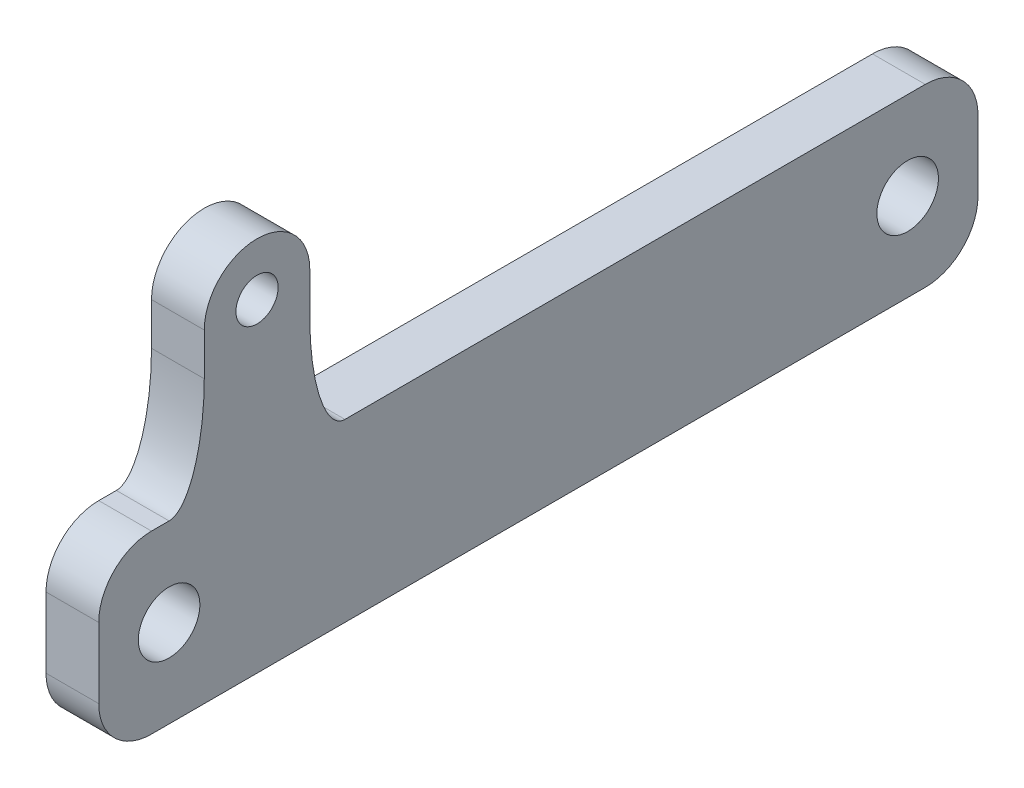
ISO-10303-21;
HEADER;
FILE_DESCRIPTION(('STEP AP214'),'2;1');
FILE_NAME('part.step','',(''),(''),'','','');
FILE_SCHEMA(('AUTOMOTIVE_DESIGN { 1 0 10303 214 1 1 1 1 }'));
ENDSEC;
DATA;
#1=APPLICATION_CONTEXT('core data for automotive mechanical design processes');
#2=APPLICATION_PROTOCOL_DEFINITION('international standard','automotive_design',2000,#1);
#3=PRODUCT_CONTEXT('',#1,'mechanical');
#4=PRODUCT('Part','Part','',(#3));
#5=PRODUCT_RELATED_PRODUCT_CATEGORY('part','',(#4));
#6=PRODUCT_DEFINITION_FORMATION('','',#4);
#7=PRODUCT_DEFINITION_CONTEXT('part definition',#1,'design');
#8=PRODUCT_DEFINITION('design','',#6,#7);
#9=PRODUCT_DEFINITION_SHAPE('','',#8);
#10=(LENGTH_UNIT() NAMED_UNIT(*) SI_UNIT(.MILLI.,.METRE.));
#11=(NAMED_UNIT(*) PLANE_ANGLE_UNIT() SI_UNIT($,.RADIAN.));
#12=(NAMED_UNIT(*) SI_UNIT($,.STERADIAN.) SOLID_ANGLE_UNIT());
#13=UNCERTAINTY_MEASURE_WITH_UNIT(LENGTH_MEASURE(1.E-05),#10,'distance_accuracy_value','');
#14=(GEOMETRIC_REPRESENTATION_CONTEXT(3) GLOBAL_UNCERTAINTY_ASSIGNED_CONTEXT((#13)) GLOBAL_UNIT_ASSIGNED_CONTEXT((#10,
#11,#12)) REPRESENTATION_CONTEXT('',''));
#15=CARTESIAN_POINT('',(0.,0.,0.));
#16=DIRECTION('',(0.,0.,1.));
#17=DIRECTION('',(1.,0.,0.));
#18=AXIS2_PLACEMENT_3D('',#15,#16,#17);
#19=CARTESIAN_POINT('',(-61.0000000000002,-7.50000000000045,105.000000000001));
#20=DIRECTION('',(0.,-0.999999999999999,0.));
#21=DIRECTION('',(1.,0.,0.));
#22=AXIS2_PLACEMENT_3D('',#19,#20,#21);
#23=PLANE('',#22);
#24=DIRECTION('',(0.,0.,-0.999999999999999));
#25=VECTOR('',#24,1.);
#26=CARTESIAN_POINT('',(-46.0000000000003,-7.50000000000145,105.000000000001));
#27=LINE('',#26,#25);
#28=CARTESIAN_POINT('',(-45.9999999999998,-7.50000000000162,34.9999999999997));
#29=VERTEX_POINT('',#28);
#30=CARTESIAN_POINT('',(-46.0000000000003,-7.50000000000092,-129.999999999997));
#31=VERTEX_POINT('',#30);
#32=EDGE_CURVE('E194',#29,#31,#27,.T.);
#33=ORIENTED_EDGE('',*,*,#32,.T.);
#34=DIRECTION('',(-1.,0.,0.));
#35=VECTOR('',#34,1.);
#36=CARTESIAN_POINT('',(-61.0000000000002,-7.50000000000114,-129.999999999998));
#37=LINE('',#36,#35);
#38=CARTESIAN_POINT('',(-61.0000000000002,-7.50000000000114,-129.999999999998));
#39=VERTEX_POINT('',#38);
#40=EDGE_CURVE('E312',#31,#39,#37,.T.);
#41=ORIENTED_EDGE('',*,*,#40,.T.);
#42=DIRECTION('',(0.,0.,-0.999999999999999));
#43=VECTOR('',#42,1.);
#44=CARTESIAN_POINT('',(-61.0000000000002,-7.50000000000045,105.000000000001));
#45=LINE('',#44,#43);
#46=CARTESIAN_POINT('',(-60.9999999999997,-7.50000000000128,35.0000000000001));
#47=VERTEX_POINT('',#46);
#48=EDGE_CURVE('E375',#47,#39,#45,.T.);
#49=ORIENTED_EDGE('',*,*,#48,.F.);
#50=CARTESIAN_POINT('',(-45.2499999999998,-7.50000000000162,34.9999999999997));
#51=CARTESIAN_POINT('',(-50.7499999999996,-7.50000000000148,34.9999999999998));
#52=CARTESIAN_POINT('',(-56.2499999999997,-7.50000000000142,35.0000000000001));
#53=CARTESIAN_POINT('',(-61.7499999999997,-7.50000000000151,35.0000000000004));
#54=(BOUNDED_CURVE() B_SPLINE_CURVE(3,(#50,#51,#52,#53),.UNSPECIFIED.,.F.,
.F.) B_SPLINE_CURVE_WITH_KNOTS((4,4),(0.0636627316607518,0.0801627316607518),
.UNSPECIFIED.) CURVE() GEOMETRIC_REPRESENTATION_ITEM() RATIONAL_B_SPLINE_CURVE((1.,1.,1.,1.)) REPRESENTATION_ITEM(''));
#55=EDGE_CURVE('E314',#47,#29,#54,.F.);
#56=ORIENTED_EDGE('',*,*,#55,.T.);
#57=EDGE_LOOP('',(#33,#41,#49,#56));
#58=FACE_BOUND('',#57,.T.);
#59=ADVANCED_FACE('F42',(#58),#23,.F.);
#60=CARTESIAN_POINT('',(-60.9999999999984,-7.50000000000128,90.0000000000003));
#61=VERTEX_POINT('',#60);
#62=CARTESIAN_POINT('',(-60.9999999999987,-7.50000000000053,84.9999999999997));
#63=VERTEX_POINT('',#62);
#64=EDGE_CURVE('E372',#61,#63,#45,.T.);
#65=ORIENTED_EDGE('',*,*,#64,.F.);
#66=DIRECTION('',(-1.,0.,0.));
#67=VECTOR('',#66,1.);
#68=CARTESIAN_POINT('',(-60.9999999999984,-7.50000000000128,90.0000000000003));
#69=LINE('',#68,#67);
#70=CARTESIAN_POINT('',(-45.9999999999982,-7.5000000000004,90.0000000000029));
#71=VERTEX_POINT('',#70);
#72=EDGE_CURVE('E12',#61,#71,#69,.F.);
#73=ORIENTED_EDGE('',*,*,#72,.T.);
#74=CARTESIAN_POINT('',(-45.9999999999988,-7.50000000000067,85.0000000000024));
#75=VERTEX_POINT('',#74);
#76=EDGE_CURVE('E317',#71,#75,#27,.T.);
#77=ORIENTED_EDGE('',*,*,#76,.T.);
#78=CARTESIAN_POINT('',(-61.7499999999987,-7.5000000000012,85.000000000002));
#79=CARTESIAN_POINT('',(-56.2499999999989,-7.50000000000056,85.));
#80=CARTESIAN_POINT('',(-50.7499999999988,-7.49999999999937,85.0000000000029));
#81=CARTESIAN_POINT('',(-45.2499999999988,-7.50000000000114,85.000000000002));
#82=(BOUNDED_CURVE() B_SPLINE_CURVE(3,(#78,#79,#80,#81),.UNSPECIFIED.,.F.,
.F.) B_SPLINE_CURVE_WITH_KNOTS((4,4),(-0.01575,0.000750000000000001),
.UNSPECIFIED.) CURVE() GEOMETRIC_REPRESENTATION_ITEM() RATIONAL_B_SPLINE_CURVE((1.,1.,1.,1.)) REPRESENTATION_ITEM(''));
#83=EDGE_CURVE('E393',#75,#63,#82,.F.);
#84=ORIENTED_EDGE('',*,*,#83,.T.);
#85=EDGE_LOOP('',(#65,#73,#77,#84));
#86=FACE_BOUND('',#85,.T.);
#87=ADVANCED_FACE('F244',(#86),#23,.F.);
#88=CARTESIAN_POINT('',(-61.0000000000002,-7.50000000000045,105.000000000001));
#89=DIRECTION('',(1.,0.,0.));
#90=DIRECTION('',(0.,0.999999999999999,0.));
#91=AXIS2_PLACEMENT_3D('',#88,#89,#90);
#92=PLANE('',#91);
#93=CARTESIAN_POINT('',(-60.9999999999993,-32.5000000000014,-124.999999999998));
#94=DIRECTION('',(-1.,0.,0.));
#95=DIRECTION('',(0.,-0.999999999999999,0.));
#96=AXIS2_PLACEMENT_3D('',#93,#94,#95);
#97=CIRCLE('',#96,8.75000000000001);
#98=CARTESIAN_POINT('',(-60.9999999999992,-41.2500000000014,-124.999999999998));
#99=VERTEX_POINT('',#98);
#100=EDGE_CURVE('E423',#99,#99,#97,.T.);
#101=ORIENTED_EDGE('',*,*,#100,.F.);
#102=EDGE_LOOP('',(#101));
#103=FACE_BOUND('',#102,.T.);
#104=CARTESIAN_POINT('',(-60.9999999999986,-32.5000000000007,85.0000000000002));
#105=DIRECTION('',(-1.,0.,0.));
#106=DIRECTION('',(0.,0.999999999999999,0.));
#107=AXIS2_PLACEMENT_3D('',#104,#105,#106);
#108=CIRCLE('',#107,8.75000000000001);
#109=CARTESIAN_POINT('',(-60.9999999999986,-23.7500000000007,85.0000000000002));
#110=VERTEX_POINT('',#109);
#111=EDGE_CURVE('E421',#110,#110,#108,.T.);
#112=ORIENTED_EDGE('',*,*,#111,.F.);
#113=EDGE_LOOP('',(#112));
#114=FACE_BOUND('',#113,.T.);
#115=DIRECTION('',(0.,-0.999999999999999,0.));
#116=VECTOR('',#115,1.);
#117=CARTESIAN_POINT('',(-61.0000000000007,-7.50000000000112,-145.));
#118=LINE('',#117,#116);
#119=CARTESIAN_POINT('',(-60.999999999999,-22.5000000000011,-144.999999999998));
#120=VERTEX_POINT('',#119);
#121=CARTESIAN_POINT('',(-60.9999999999988,-42.5000000000007,-144.999999999999));
#122=VERTEX_POINT('',#121);
#123=EDGE_CURVE('E349',#120,#122,#118,.T.);
#124=ORIENTED_EDGE('',*,*,#123,.T.);
#125=CARTESIAN_POINT('',(-60.9999999999993,-42.499999999999,-129.999999999997));
#126=DIRECTION('',(1.,0.,0.));
#127=DIRECTION('',(0.,0.999999999999999,0.));
#128=AXIS2_PLACEMENT_3D('',#125,#126,#127);
#129=CIRCLE('',#128,15.);
#130=CARTESIAN_POINT('',(-60.9999999999989,-57.5000000000009,-129.999999999998));
#131=VERTEX_POINT('',#130);
#132=EDGE_CURVE('E323',#122,#131,#129,.F.);
#133=ORIENTED_EDGE('',*,*,#132,.T.);
#134=DIRECTION('',(0.,0.,-0.999999999999999));
#135=VECTOR('',#134,1.);
#136=CARTESIAN_POINT('',(-60.9999999999976,-57.5000000000002,105.000000000001));
#137=LINE('',#136,#135);
#138=CARTESIAN_POINT('',(-60.9999999999987,-57.5,90.0000000000019));
#139=VERTEX_POINT('',#138);
#140=EDGE_CURVE('E379',#139,#131,#137,.T.);
#141=ORIENTED_EDGE('',*,*,#140,.F.);
#142=CARTESIAN_POINT('',(-60.9999999999989,-42.5000000000005,90.0000000000019));
#143=DIRECTION('',(1.,0.,0.));
#144=DIRECTION('',(0.,0.999999999999999,0.));
#145=AXIS2_PLACEMENT_3D('',#142,#143,#144);
#146=CIRCLE('',#145,15.);
#147=CARTESIAN_POINT('',(-60.9999999999994,-42.5000000000007,105.000000000002));
#148=VERTEX_POINT('',#147);
#149=EDGE_CURVE('E533',#139,#148,#146,.F.);
#150=ORIENTED_EDGE('',*,*,#149,.T.);
#151=DIRECTION('',(0.,-0.999999999999999,0.));
#152=VECTOR('',#151,1.);
#153=CARTESIAN_POINT('',(-61.0000000000002,-7.50000000000045,105.000000000001));
#154=LINE('',#153,#152);
#155=CARTESIAN_POINT('',(-60.9999999999987,-22.5000000000005,105.000000000002));
#156=VERTEX_POINT('',#155);
#157=EDGE_CURVE('E335',#156,#148,#154,.T.);
#158=ORIENTED_EDGE('',*,*,#157,.F.);
#159=CARTESIAN_POINT('',(-60.9999999999986,-22.5000000000011,90.0000000000022));
#160=DIRECTION('',(1.,0.,0.));
#161=DIRECTION('',(0.,0.999999999999999,0.));
#162=AXIS2_PLACEMENT_3D('',#159,#160,#161);
#163=CIRCLE('',#162,15.);
#164=EDGE_CURVE('E65',#156,#61,#163,.F.);
#165=ORIENTED_EDGE('',*,*,#164,.T.);
#166=ORIENTED_EDGE('',*,*,#64,.T.);
#167=CARTESIAN_POINT('',(-60.999999999999,22.4999999999982,74.999999999999));
#168=CARTESIAN_POINT('',(-61.0000000000007,-7.49999999999692,74.9999999999995));
#169=CARTESIAN_POINT('',(-60.9999999999988,-7.50000000000111,85.0000000000017));
#170=(BOUNDED_CURVE() B_SPLINE_CURVE(2,(#167,#168,#169),.UNSPECIFIED.,.F.,
.F.) B_SPLINE_CURVE_WITH_KNOTS((3,3),(0.,1.),
.UNSPECIFIED.) CURVE() GEOMETRIC_REPRESENTATION_ITEM() RATIONAL_B_SPLINE_CURVE((1.,
0.707106781186547,1.)) REPRESENTATION_ITEM(''));
#171=CARTESIAN_POINT('',(-60.9999999999989,22.4999999999983,74.9999999999986));
#172=VERTEX_POINT('',#171);
#173=EDGE_CURVE('E152',#63,#172,#170,.F.);
#174=ORIENTED_EDGE('',*,*,#173,.T.);
#175=DIRECTION('',(0.,0.999999999999999,0.));
#176=VECTOR('',#175,1.);
#177=CARTESIAN_POINT('',(-60.9999999999981,-7.50000000000159,74.9999999999991));
#178=LINE('',#177,#176);
#179=CARTESIAN_POINT('',(-60.9999999999988,34.4999999999986,75.0000000000028));
#180=VERTEX_POINT('',#179);
#181=EDGE_CURVE('E142',#172,#180,#178,.T.);
#182=ORIENTED_EDGE('',*,*,#181,.T.);
#183=CARTESIAN_POINT('',(-60.9999999999993,34.4999999999987,59.9999999999997));
#184=DIRECTION('',(-1.,0.,0.));
#185=DIRECTION('',(0.,0.999999999999999,0.));
#186=AXIS2_PLACEMENT_3D('',#183,#184,#185);
#187=CIRCLE('',#186,15.);
#188=CARTESIAN_POINT('',(-60.9999999999989,34.4999999999997,45.0000000000019));
#189=VERTEX_POINT('',#188);
#190=EDGE_CURVE('E149',#180,#189,#187,.T.);
#191=ORIENTED_EDGE('',*,*,#190,.T.);
#192=DIRECTION('',(0.,-0.999999999999999,0.));
#193=VECTOR('',#192,1.);
#194=CARTESIAN_POINT('',(-60.9999999999988,-7.50000000000109,45.000000000001));
#195=LINE('',#194,#193);
#196=CARTESIAN_POINT('',(-60.9999999999991,22.4999999999986,45.0000000000027));
#197=VERTEX_POINT('',#196);
#198=EDGE_CURVE('E167',#189,#197,#195,.T.);
#199=ORIENTED_EDGE('',*,*,#198,.T.);
#200=CARTESIAN_POINT('',(-60.9999999999998,-7.50000000000149,35.0000000000003));
#201=CARTESIAN_POINT('',(-60.9999999999998,-7.49999999999991,45.0000000000014));
#202=CARTESIAN_POINT('',(-60.9999999999989,22.4999999999985,45.0000000000015));
#203=(BOUNDED_CURVE() B_SPLINE_CURVE(2,(#200,#201,#202),.UNSPECIFIED.,.F.,
.F.) B_SPLINE_CURVE_WITH_KNOTS((3,3),(0.,1.),
.UNSPECIFIED.) CURVE() GEOMETRIC_REPRESENTATION_ITEM() RATIONAL_B_SPLINE_CURVE((1.,
0.707106781186548,1.)) REPRESENTATION_ITEM(''));
#204=EDGE_CURVE('E227',#197,#47,#203,.F.);
#205=ORIENTED_EDGE('',*,*,#204,.T.);
#206=ORIENTED_EDGE('',*,*,#48,.T.);
#207=CARTESIAN_POINT('',(-60.9999999999987,-22.500000000001,-129.999999999999));
#208=DIRECTION('',(1.,0.,0.));
#209=DIRECTION('',(0.,0.999999999999999,0.));
#210=AXIS2_PLACEMENT_3D('',#207,#208,#209);
#211=CIRCLE('',#210,15.);
#212=EDGE_CURVE('E57',#39,#120,#211,.F.);
#213=ORIENTED_EDGE('',*,*,#212,.T.);
#214=EDGE_LOOP('',(#124,#133,#141,#150,#158,#165,#166,#174,#182,#191,#199,#205,#206,#213));
#215=FACE_BOUND('',#214,.T.);
#216=CARTESIAN_POINT('',(-60.9999999999993,34.4999999999987,59.9999999999997));
#217=DIRECTION('',(-1.,0.,0.));
#218=DIRECTION('',(0.,-0.999999999999999,0.));
#219=AXIS2_PLACEMENT_3D('',#216,#217,#218);
#220=CIRCLE('',#219,5.99999999999999);
#221=CARTESIAN_POINT('',(-60.9999999999992,28.4999999999987,59.9999999999997));
#222=VERTEX_POINT('',#221);
#223=EDGE_CURVE('E156',#222,#222,#220,.T.);
#224=ORIENTED_EDGE('',*,*,#223,.F.);
#225=EDGE_LOOP('',(#224));
#226=FACE_BOUND('',#225,.T.);
#227=ADVANCED_FACE('F145',(#103,#114,#215,#226),#92,.F.);
#228=CARTESIAN_POINT('',(-45.9999999999975,-57.5000000000008,105.000000000001));
#229=DIRECTION('',(0.,0.999999999999999,0.));
#230=DIRECTION('',(-1.,0.,0.));
#231=AXIS2_PLACEMENT_3D('',#228,#229,#230);
#232=PLANE('',#231);
#233=ORIENTED_EDGE('',*,*,#140,.T.);
#234=DIRECTION('',(1.,0.,0.));
#235=VECTOR('',#234,1.);
#236=CARTESIAN_POINT('',(-45.999999999999,-57.5,-129.999999999998));
#237=LINE('',#236,#235);
#238=CARTESIAN_POINT('',(-45.999999999999,-57.5,-129.999999999998));
#239=VERTEX_POINT('',#238);
#240=EDGE_CURVE('E361',#131,#239,#237,.T.);
#241=ORIENTED_EDGE('',*,*,#240,.T.);
#242=DIRECTION('',(0.,0.,-0.999999999999999));
#243=VECTOR('',#242,1.);
#244=CARTESIAN_POINT('',(-45.9999999999975,-57.5000000000008,105.000000000001));
#245=LINE('',#244,#243);
#246=CARTESIAN_POINT('',(-45.9999999999986,-57.5000000000007,90.0000000000016));
#247=VERTEX_POINT('',#246);
#248=EDGE_CURVE('E355',#247,#239,#245,.T.);
#249=ORIENTED_EDGE('',*,*,#248,.F.);
#250=DIRECTION('',(1.,0.,0.));
#251=VECTOR('',#250,1.);
#252=CARTESIAN_POINT('',(-45.9999999999986,-57.5000000000007,90.0000000000016));
#253=LINE('',#252,#251);
#254=EDGE_CURVE('E515',#247,#139,#253,.F.);
#255=ORIENTED_EDGE('',*,*,#254,.T.);
#256=EDGE_LOOP('',(#233,#241,#249,#255));
#257=FACE_BOUND('',#256,.T.);
#258=ADVANCED_FACE('F243',(#257),#232,.F.);
#259=CARTESIAN_POINT('',(-46.0000000000003,-7.50000000000145,105.000000000001));
#260=DIRECTION('',(-1.,0.,0.));
#261=DIRECTION('',(0.,-0.999999999999999,0.));
#262=AXIS2_PLACEMENT_3D('',#259,#260,#261);
#263=PLANE('',#262);
#264=CARTESIAN_POINT('',(-45.9999999999992,-32.5000000000008,-124.999999999998));
#265=DIRECTION('',(-1.,0.,0.));
#266=DIRECTION('',(0.,-0.999999999999999,0.));
#267=AXIS2_PLACEMENT_3D('',#264,#265,#266);
#268=CIRCLE('',#267,8.75000000000001);
#269=CARTESIAN_POINT('',(-45.9999999999991,-41.2500000000008,-124.999999999998));
#270=VERTEX_POINT('',#269);
#271=EDGE_CURVE('E351',#270,#270,#268,.T.);
#272=ORIENTED_EDGE('',*,*,#271,.T.);
#273=EDGE_LOOP('',(#272));
#274=FACE_BOUND('',#273,.T.);
#275=CARTESIAN_POINT('',(-45.9999999999984,-32.5000000000008,85.0000000000001));
#276=DIRECTION('',(-1.,0.,0.));
#277=DIRECTION('',(0.,-0.999999999999999,0.));
#278=AXIS2_PLACEMENT_3D('',#275,#276,#277);
#279=CIRCLE('',#278,8.75000000000001);
#280=CARTESIAN_POINT('',(-45.9999999999984,-41.2500000000008,85.0000000000001));
#281=VERTEX_POINT('',#280);
#282=EDGE_CURVE('E380',#281,#281,#279,.T.);
#283=ORIENTED_EDGE('',*,*,#282,.T.);
#284=EDGE_LOOP('',(#283));
#285=FACE_BOUND('',#284,.T.);
#286=ORIENTED_EDGE('',*,*,#248,.T.);
#287=CARTESIAN_POINT('',(-45.9999999999992,-42.5000000000012,-129.999999999999));
#288=DIRECTION('',(-1.,0.,0.));
#289=DIRECTION('',(0.,-0.999999999999999,0.));
#290=AXIS2_PLACEMENT_3D('',#287,#288,#289);
#291=CIRCLE('',#290,15.);
#292=CARTESIAN_POINT('',(-45.9999999999987,-42.5000000000003,-144.999999999998));
#293=VERTEX_POINT('',#292);
#294=EDGE_CURVE('E366',#239,#293,#291,.F.);
#295=ORIENTED_EDGE('',*,*,#294,.T.);
#296=DIRECTION('',(0.,0.999999999999999,0.));
#297=VECTOR('',#296,1.);
#298=CARTESIAN_POINT('',(-46.0000000000006,-7.50000000000087,-144.999999999999));
#299=LINE('',#298,#297);
#300=CARTESIAN_POINT('',(-45.9999999999989,-22.500000000001,-144.999999999998));
#301=VERTEX_POINT('',#300);
#302=EDGE_CURVE('E345',#293,#301,#299,.T.);
#303=ORIENTED_EDGE('',*,*,#302,.T.);
#304=CARTESIAN_POINT('',(-45.9999999999986,-22.5000000000014,-129.999999999999));
#305=DIRECTION('',(-1.,0.,0.));
#306=DIRECTION('',(0.,-0.999999999999999,0.));
#307=AXIS2_PLACEMENT_3D('',#304,#305,#306);
#308=CIRCLE('',#307,15.);
#309=EDGE_CURVE('E321',#301,#31,#308,.F.);
#310=ORIENTED_EDGE('',*,*,#309,.T.);
#311=ORIENTED_EDGE('',*,*,#32,.F.);
#312=CARTESIAN_POINT('',(-45.9999999999989,22.5,45.0000000000035));
#313=CARTESIAN_POINT('',(-45.9999999999998,-7.49999999999976,45.0000000000016));
#314=CARTESIAN_POINT('',(-45.9999999999998,-7.5000000000016,34.9999999999997));
#315=(BOUNDED_CURVE() B_SPLINE_CURVE(2,(#312,#313,#314),.UNSPECIFIED.,.F.,
.F.) B_SPLINE_CURVE_WITH_KNOTS((3,3),(0.,1.),
.UNSPECIFIED.) CURVE() GEOMETRIC_REPRESENTATION_ITEM() RATIONAL_B_SPLINE_CURVE((1.,
0.707106781186548,1.)) REPRESENTATION_ITEM(''));
#316=CARTESIAN_POINT('',(-45.999999999999,22.5000000000005,45.0000000000038));
#317=VERTEX_POINT('',#316);
#318=EDGE_CURVE('E526',#29,#317,#315,.F.);
#319=ORIENTED_EDGE('',*,*,#318,.T.);
#320=DIRECTION('',(0.,0.999999999999999,0.));
#321=VECTOR('',#320,1.);
#322=CARTESIAN_POINT('',(-45.9999999999989,-7.50000000000056,45.0000000000024));
#323=LINE('',#322,#321);
#324=CARTESIAN_POINT('',(-45.9999999999988,34.5000000000001,45.0000000000004));
#325=VERTEX_POINT('',#324);
#326=EDGE_CURVE('E181',#317,#325,#323,.T.);
#327=ORIENTED_EDGE('',*,*,#326,.T.);
#328=CARTESIAN_POINT('',(-45.9999999999991,34.4999999999994,60.0000000000013));
#329=DIRECTION('',(-1.,0.,0.));
#330=DIRECTION('',(0.,-0.999999999999999,0.));
#331=AXIS2_PLACEMENT_3D('',#328,#329,#330);
#332=CIRCLE('',#331,15.);
#333=CARTESIAN_POINT('',(-45.9999999999987,34.4999999999985,75.0000000000035));
#334=VERTEX_POINT('',#333);
#335=EDGE_CURVE('E406',#325,#334,#332,.F.);
#336=ORIENTED_EDGE('',*,*,#335,.T.);
#337=DIRECTION('',(0.,-0.999999999999999,0.));
#338=VECTOR('',#337,1.);
#339=CARTESIAN_POINT('',(-45.9999999999982,-7.50000000000145,74.9999999999984));
#340=LINE('',#339,#338);
#341=CARTESIAN_POINT('',(-45.999999999999,22.4999999999979,75.0000000000005));
#342=VERTEX_POINT('',#341);
#343=EDGE_CURVE('E163',#334,#342,#340,.T.);
#344=ORIENTED_EDGE('',*,*,#343,.T.);
#345=CARTESIAN_POINT('',(-45.9999999999988,-7.50000000000092,85.000000000002));
#346=CARTESIAN_POINT('',(-46.0000000000007,-7.50000000000033,75.0000000000008));
#347=CARTESIAN_POINT('',(-45.999999999999,22.4999999999978,75.0000000000003));
#348=(BOUNDED_CURVE() B_SPLINE_CURVE(2,(#345,#346,#347),.UNSPECIFIED.,.F.,
.F.) B_SPLINE_CURVE_WITH_KNOTS((3,3),(0.,1.),
.UNSPECIFIED.) CURVE() GEOMETRIC_REPRESENTATION_ITEM() RATIONAL_B_SPLINE_CURVE((1.,
0.707106781186547,1.)) REPRESENTATION_ITEM(''));
#349=EDGE_CURVE('E264',#342,#75,#348,.F.);
#350=ORIENTED_EDGE('',*,*,#349,.T.);
#351=ORIENTED_EDGE('',*,*,#76,.F.);
#352=CARTESIAN_POINT('',(-45.9999999999984,-22.5000000000009,90.0000000000003));
#353=DIRECTION('',(-1.,0.,0.));
#354=DIRECTION('',(0.,-0.999999999999999,0.));
#355=AXIS2_PLACEMENT_3D('',#352,#353,#354);
#356=CIRCLE('',#355,15.);
#357=CARTESIAN_POINT('',(-45.9999999999986,-22.5000000000017,105.));
#358=VERTEX_POINT('',#357);
#359=EDGE_CURVE('E343',#71,#358,#356,.F.);
#360=ORIENTED_EDGE('',*,*,#359,.T.);
#361=DIRECTION('',(0.,0.999999999999999,0.));
#362=VECTOR('',#361,1.);
#363=CARTESIAN_POINT('',(-46.0000000000003,-7.50000000000145,105.000000000001));
#364=LINE('',#363,#362);
#365=CARTESIAN_POINT('',(-45.9999999999993,-42.5000000000011,105.000000000002));
#366=VERTEX_POINT('',#365);
#367=EDGE_CURVE('E318',#366,#358,#364,.T.);
#368=ORIENTED_EDGE('',*,*,#367,.F.);
#369=CARTESIAN_POINT('',(-45.999999999999,-42.500000000001,90.0000000000007));
#370=DIRECTION('',(-1.,0.,0.));
#371=DIRECTION('',(0.,-0.999999999999999,0.));
#372=AXIS2_PLACEMENT_3D('',#369,#370,#371);
#373=CIRCLE('',#372,15.);
#374=EDGE_CURVE('E340',#366,#247,#373,.F.);
#375=ORIENTED_EDGE('',*,*,#374,.T.);
#376=EDGE_LOOP('',(#286,#295,#303,#310,#311,#319,#327,#336,#344,#350,#351,#360,#368,#375));
#377=FACE_BOUND('',#376,.T.);
#378=CARTESIAN_POINT('',(-45.9999999999991,34.4999999999994,60.0000000000013));
#379=DIRECTION('',(-1.,0.,0.));
#380=DIRECTION('',(0.,-0.999999999999999,0.));
#381=AXIS2_PLACEMENT_3D('',#378,#379,#380);
#382=CIRCLE('',#381,5.99999999999999);
#383=CARTESIAN_POINT('',(-45.9999999999991,28.4999999999995,60.0000000000013));
#384=VERTEX_POINT('',#383);
#385=EDGE_CURVE('E403',#384,#384,#382,.F.);
#386=ORIENTED_EDGE('',*,*,#385,.F.);
#387=EDGE_LOOP('',(#386));
#388=FACE_BOUND('',#387,.T.);
#389=ADVANCED_FACE('F270',(#274,#285,#377,#388),#263,.F.);
#390=CARTESIAN_POINT('',(7.50000000000081,-25.0000000000017,105.000000000002));
#391=DIRECTION('',(0.,0.,-0.999999999999999));
#392=DIRECTION('',(-1.,0.,0.));
#393=AXIS2_PLACEMENT_3D('',#390,#391,#392);
#394=PLANE('',#393);
#395=ORIENTED_EDGE('',*,*,#157,.T.);
#396=DIRECTION('',(1.,0.,0.));
#397=VECTOR('',#396,1.);
#398=CARTESIAN_POINT('',(7.50000000000089,-42.5000000000002,105.000000000001));
#399=LINE('',#398,#397);
#400=EDGE_CURVE('E50',#148,#366,#399,.T.);
#401=ORIENTED_EDGE('',*,*,#400,.T.);
#402=ORIENTED_EDGE('',*,*,#367,.T.);
#403=DIRECTION('',(-1.,0.,0.));
#404=VECTOR('',#403,1.);
#405=CARTESIAN_POINT('',(7.50000000000081,-22.5000000000009,104.999999999999));
#406=LINE('',#405,#404);
#407=EDGE_CURVE('E322',#358,#156,#406,.T.);
#408=ORIENTED_EDGE('',*,*,#407,.T.);
#409=EDGE_LOOP('',(#395,#401,#402,#408));
#410=FACE_BOUND('',#409,.T.);
#411=ADVANCED_FACE('F279',(#410),#394,.F.);
#412=CARTESIAN_POINT('',(7.50000000000081,-25.0000000000007,-144.999999999998));
#413=DIRECTION('',(0.,0.,-0.999999999999999));
#414=DIRECTION('',(-1.,0.,0.));
#415=AXIS2_PLACEMENT_3D('',#412,#413,#414);
#416=PLANE('',#415);
#417=ORIENTED_EDGE('',*,*,#302,.F.);
#418=DIRECTION('',(1.,0.,0.));
#419=VECTOR('',#418,1.);
#420=CARTESIAN_POINT('',(-60.9999999999988,-42.5000000000007,-144.999999999999));
#421=LINE('',#420,#419);
#422=EDGE_CURVE('E370',#293,#122,#421,.F.);
#423=ORIENTED_EDGE('',*,*,#422,.T.);
#424=ORIENTED_EDGE('',*,*,#123,.F.);
#425=DIRECTION('',(-1.,0.,0.));
#426=VECTOR('',#425,1.);
#427=CARTESIAN_POINT('',(-45.9999999999989,-22.500000000001,-144.999999999998));
#428=LINE('',#427,#426);
#429=EDGE_CURVE('E368',#120,#301,#428,.F.);
#430=ORIENTED_EDGE('',*,*,#429,.T.);
#431=EDGE_LOOP('',(#417,#423,#424,#430));
#432=FACE_BOUND('',#431,.T.);
#433=ADVANCED_FACE('F281',(#432),#416,.T.);
#434=CARTESIAN_POINT('',(61.0000000000012,-32.5000000000008,85.0000000000033));
#435=DIRECTION('',(-1.,0.,0.));
#436=DIRECTION('',(0.,-0.999999999999999,0.));
#437=AXIS2_PLACEMENT_3D('',#434,#435,#436);
#438=CYLINDRICAL_SURFACE('',#437,8.75000000000001);
#439=ORIENTED_EDGE('',*,*,#111,.T.);
#440=EDGE_LOOP('',(#439));
#441=FACE_BOUND('',#440,.T.);
#442=ORIENTED_EDGE('',*,*,#282,.F.);
#443=EDGE_LOOP('',(#442));
#444=FACE_BOUND('',#443,.T.);
#445=ADVANCED_FACE('F292',(#441,#444),#438,.F.);
#446=CARTESIAN_POINT('',(61.0000000000008,-32.5000000000012,-124.999999999998));
#447=DIRECTION('',(-1.,0.,0.));
#448=DIRECTION('',(0.,-0.999999999999999,0.));
#449=AXIS2_PLACEMENT_3D('',#446,#447,#448);
#450=CYLINDRICAL_SURFACE('',#449,8.75000000000001);
#451=ORIENTED_EDGE('',*,*,#100,.T.);
#452=EDGE_LOOP('',(#451));
#453=FACE_BOUND('',#452,.T.);
#454=ORIENTED_EDGE('',*,*,#271,.F.);
#455=EDGE_LOOP('',(#454));
#456=FACE_BOUND('',#455,.T.);
#457=ADVANCED_FACE('F213',(#453,#456),#450,.F.);
#458=CARTESIAN_POINT('',(18.4127316607526,-7.50000000000006,75.0000000000026));
#459=DIRECTION('',(0.,0.,0.999999999999999));
#460=DIRECTION('',(0.,-0.999999999999999,0.));
#461=AXIS2_PLACEMENT_3D('',#458,#459,#460);
#462=PLANE('',#461);
#463=ORIENTED_EDGE('',*,*,#181,.F.);
#464=CARTESIAN_POINT('',(-45.249999999999,22.4999999999978,75.0000000000005));
#465=CARTESIAN_POINT('',(-50.7499999999989,22.4999999999983,74.9999999999986));
#466=CARTESIAN_POINT('',(-56.2499999999989,22.4999999999995,75.0000000000017));
#467=CARTESIAN_POINT('',(-61.749999999999,22.499999999998,74.9999999999986));
#468=(BOUNDED_CURVE() B_SPLINE_CURVE(3,(#464,#465,#466,#467),.UNSPECIFIED.,.F.,
.F.) B_SPLINE_CURVE_WITH_KNOTS((4,4),(-0.01575,0.00075),
.UNSPECIFIED.) CURVE() GEOMETRIC_REPRESENTATION_ITEM() RATIONAL_B_SPLINE_CURVE((1.,1.,1.,1.)) REPRESENTATION_ITEM(''));
#469=EDGE_CURVE('E512',#172,#342,#468,.F.);
#470=ORIENTED_EDGE('',*,*,#469,.T.);
#471=ORIENTED_EDGE('',*,*,#343,.F.);
#472=DIRECTION('',(-1.,0.,0.));
#473=VECTOR('',#472,1.);
#474=CARTESIAN_POINT('',(18.4127316607521,34.4999999999994,74.9999999999986));
#475=LINE('',#474,#473);
#476=EDGE_CURVE('E160',#334,#180,#475,.T.);
#477=ORIENTED_EDGE('',*,*,#476,.T.);
#478=EDGE_LOOP('',(#463,#470,#471,#477));
#479=FACE_BOUND('',#478,.T.);
#480=ADVANCED_FACE('F161',(#479),#462,.T.);
#481=CARTESIAN_POINT('',(18.4127316607517,34.4999999999987,59.9999999999989));
#482=DIRECTION('',(-1.,0.,0.));
#483=DIRECTION('',(0.,-0.999999999999999,0.));
#484=AXIS2_PLACEMENT_3D('',#481,#482,#483);
#485=CYLINDRICAL_SURFACE('',#484,15.);
#486=ORIENTED_EDGE('',*,*,#335,.F.);
#487=DIRECTION('',(-1.,0.,0.));
#488=VECTOR('',#487,1.);
#489=CARTESIAN_POINT('',(18.4127316607523,34.5000000000004,45.0000000000041));
#490=LINE('',#489,#488);
#491=EDGE_CURVE('E166',#325,#189,#490,.T.);
#492=ORIENTED_EDGE('',*,*,#491,.T.);
#493=ORIENTED_EDGE('',*,*,#190,.F.);
#494=ORIENTED_EDGE('',*,*,#476,.F.);
#495=EDGE_LOOP('',(#486,#492,#493,#494));
#496=FACE_BOUND('',#495,.T.);
#497=ADVANCED_FACE('F169',(#496),#485,.T.);
#498=CARTESIAN_POINT('',(18.4127316607532,-7.49999999999945,45.0000000000033));
#499=DIRECTION('',(0.,0.,-0.999999999999999));
#500=DIRECTION('',(0.,0.999999999999999,0.));
#501=AXIS2_PLACEMENT_3D('',#498,#499,#500);
#502=PLANE('',#501);
#503=ORIENTED_EDGE('',*,*,#326,.F.);
#504=CARTESIAN_POINT('',(-61.7499999999989,22.4999999999983,45.0000000000017));
#505=CARTESIAN_POINT('',(-56.2499999999991,22.4999999999999,45.0000000000001));
#506=CARTESIAN_POINT('',(-50.749999999999,22.5000000000005,45.0000000000034));
#507=CARTESIAN_POINT('',(-45.2499999999989,22.4999999999999,45.0000000000036));
#508=(BOUNDED_CURVE() B_SPLINE_CURVE(3,(#504,#505,#506,#507),.UNSPECIFIED.,.F.,
.F.) B_SPLINE_CURVE_WITH_KNOTS((4,4),(0.0636627316607519,0.0801627316607519),
.UNSPECIFIED.) CURVE() GEOMETRIC_REPRESENTATION_ITEM() RATIONAL_B_SPLINE_CURVE((1.,1.,1.,1.)) REPRESENTATION_ITEM(''));
#509=EDGE_CURVE('E189',#317,#197,#508,.F.);
#510=ORIENTED_EDGE('',*,*,#509,.T.);
#511=ORIENTED_EDGE('',*,*,#198,.F.);
#512=ORIENTED_EDGE('',*,*,#491,.F.);
#513=EDGE_LOOP('',(#503,#510,#511,#512));
#514=FACE_BOUND('',#513,.T.);
#515=ADVANCED_FACE('F197',(#514),#502,.T.);
#516=CARTESIAN_POINT('',(18.4127316607517,34.4999999999987,59.9999999999989));
#517=DIRECTION('',(-1.,0.,0.));
#518=DIRECTION('',(0.,-0.999999999999999,0.));
#519=AXIS2_PLACEMENT_3D('',#516,#517,#518);
#520=CYLINDRICAL_SURFACE('',#519,5.99999999999999);
#521=ORIENTED_EDGE('',*,*,#385,.T.);
#522=EDGE_LOOP('',(#521));
#523=FACE_BOUND('',#522,.T.);
#524=ORIENTED_EDGE('',*,*,#223,.T.);
#525=EDGE_LOOP('',(#524));
#526=FACE_BOUND('',#525,.T.);
#527=ADVANCED_FACE('F207',(#523,#526),#520,.F.);
#528=CARTESIAN_POINT('',(-45.2499999999989,22.4999999999999,45.0000000000036));
#529=CARTESIAN_POINT('',(-50.749999999999,22.5000000000005,45.0000000000034));
#530=CARTESIAN_POINT('',(-56.2499999999991,22.4999999999999,45.0000000000001));
#531=CARTESIAN_POINT('',(-61.7499999999989,22.4999999999983,45.0000000000017));
#532=CARTESIAN_POINT('',(-45.2499999999998,-7.49999999999979,45.0000000000017));
#533=CARTESIAN_POINT('',(-50.7499999999999,-7.49999999999944,45.0000000000014));
#534=CARTESIAN_POINT('',(-56.2499999999998,-7.50000000000156,45.0000000000017));
#535=CARTESIAN_POINT('',(-61.7499999999998,-7.49999999999968,45.0000000000014));
#536=CARTESIAN_POINT('',(-45.2499999999998,-7.50000000000162,34.9999999999997));
#537=CARTESIAN_POINT('',(-50.7499999999996,-7.50000000000148,34.9999999999998));
#538=CARTESIAN_POINT('',(-56.2499999999997,-7.50000000000142,35.0000000000001));
#539=CARTESIAN_POINT('',(-61.7499999999997,-7.50000000000151,35.0000000000004));
#540=(BOUNDED_SURFACE() B_SPLINE_SURFACE(2,3,((#528,#529,#530,#531),(#532,#533,#534,#535),(#536,
#537,#538,#539)),.UNSPECIFIED.,.F.,.F.,.F.) B_SPLINE_SURFACE_WITH_KNOTS((3,3),(4,4),(0.,1.),
(0.0636627316607518,0.0801627316607518),
.UNSPECIFIED.) GEOMETRIC_REPRESENTATION_ITEM() RATIONAL_B_SPLINE_SURFACE(((1.,1.,1.,1.),
(0.707106781186548,0.707106781186548,0.707106781186548,0.707106781186548),(1.,1.,1.,1.))) REPRESENTATION_ITEM('') SURFACE());
#541=ORIENTED_EDGE('',*,*,#318,.F.);
#542=ORIENTED_EDGE('',*,*,#55,.F.);
#543=ORIENTED_EDGE('',*,*,#204,.F.);
#544=ORIENTED_EDGE('',*,*,#509,.F.);
#545=EDGE_LOOP('',(#541,#542,#543,#544));
#546=FACE_BOUND('',#545,.T.);
#547=ADVANCED_FACE('F412',(#546),#540,.T.);
#548=CARTESIAN_POINT('',(-45.2499999999988,-7.50000000000114,85.000000000002));
#549=CARTESIAN_POINT('',(-50.7499999999988,-7.49999999999937,85.0000000000029));
#550=CARTESIAN_POINT('',(-56.2499999999989,-7.50000000000056,85.));
#551=CARTESIAN_POINT('',(-61.7499999999987,-7.5000000000012,85.000000000002));
#552=CARTESIAN_POINT('',(-45.2500000000007,-7.50000000000094,75.0000000000011));
#553=CARTESIAN_POINT('',(-50.7500000000006,-7.49999999999623,74.9999999999992));
#554=CARTESIAN_POINT('',(-56.2500000000006,-7.49999999999713,74.9999999999995));
#555=CARTESIAN_POINT('',(-61.7500000000007,-7.49999999999689,74.9999999999995));
#556=CARTESIAN_POINT('',(-45.249999999999,22.4999999999978,75.0000000000005));
#557=CARTESIAN_POINT('',(-50.7499999999989,22.4999999999983,74.9999999999986));
#558=CARTESIAN_POINT('',(-56.2499999999989,22.4999999999995,75.0000000000017));
#559=CARTESIAN_POINT('',(-61.749999999999,22.499999999998,74.9999999999986));
#560=(BOUNDED_SURFACE() B_SPLINE_SURFACE(2,3,((#548,#549,#550,#551),(#552,#553,#554,#555),(#556,
#557,#558,#559)),.UNSPECIFIED.,.F.,.F.,.F.) B_SPLINE_SURFACE_WITH_KNOTS((3,3),(4,4),(0.,1.),
(-0.01575,0.00075),
.UNSPECIFIED.) GEOMETRIC_REPRESENTATION_ITEM() RATIONAL_B_SPLINE_SURFACE(((1.,1.,1.,1.),
(0.707106781186547,0.707106781186547,0.707106781186547,0.707106781186547),(1.,1.,1.,1.))) REPRESENTATION_ITEM('') SURFACE());
#561=ORIENTED_EDGE('',*,*,#349,.F.);
#562=ORIENTED_EDGE('',*,*,#469,.F.);
#563=ORIENTED_EDGE('',*,*,#173,.F.);
#564=ORIENTED_EDGE('',*,*,#83,.F.);
#565=EDGE_LOOP('',(#561,#562,#563,#564));
#566=FACE_BOUND('',#565,.T.);
#567=ADVANCED_FACE('F417',(#566),#560,.T.);
#568=CARTESIAN_POINT('',(-45.9999999999992,-42.5000000000012,-129.999999999999));
#569=DIRECTION('',(-1.,0.,0.));
#570=DIRECTION('',(0.,-0.999999999999999,0.));
#571=AXIS2_PLACEMENT_3D('',#568,#569,#570);
#572=CYLINDRICAL_SURFACE('',#571,15.);
#573=ORIENTED_EDGE('',*,*,#132,.F.);
#574=ORIENTED_EDGE('',*,*,#422,.F.);
#575=ORIENTED_EDGE('',*,*,#294,.F.);
#576=ORIENTED_EDGE('',*,*,#240,.F.);
#577=EDGE_LOOP('',(#573,#574,#575,#576));
#578=FACE_BOUND('',#577,.T.);
#579=ADVANCED_FACE('F438',(#578),#572,.T.);
#580=CARTESIAN_POINT('',(-60.9999999999987,-22.500000000001,-129.999999999999));
#581=DIRECTION('',(1.,0.,0.));
#582=DIRECTION('',(0.,0.999999999999999,0.));
#583=AXIS2_PLACEMENT_3D('',#580,#581,#582);
#584=CYLINDRICAL_SURFACE('',#583,15.);
#585=ORIENTED_EDGE('',*,*,#309,.F.);
#586=ORIENTED_EDGE('',*,*,#429,.F.);
#587=ORIENTED_EDGE('',*,*,#212,.F.);
#588=ORIENTED_EDGE('',*,*,#40,.F.);
#589=EDGE_LOOP('',(#585,#586,#587,#588));
#590=FACE_BOUND('',#589,.T.);
#591=ADVANCED_FACE('F320',(#590),#584,.T.);
#592=CARTESIAN_POINT('',(7.50000000000028,-42.5000000000008,90.000000000002));
#593=DIRECTION('',(1.,0.,0.));
#594=DIRECTION('',(0.,0.999999999999999,0.));
#595=AXIS2_PLACEMENT_3D('',#592,#593,#594);
#596=CYLINDRICAL_SURFACE('',#595,15.);
#597=ORIENTED_EDGE('',*,*,#149,.F.);
#598=ORIENTED_EDGE('',*,*,#254,.F.);
#599=ORIENTED_EDGE('',*,*,#374,.F.);
#600=ORIENTED_EDGE('',*,*,#400,.F.);
#601=EDGE_LOOP('',(#597,#598,#599,#600));
#602=FACE_BOUND('',#601,.T.);
#603=ADVANCED_FACE('F534',(#602),#596,.T.);
#604=CARTESIAN_POINT('',(7.50000000000073,-22.5000000000018,89.9999999999991));
#605=DIRECTION('',(-1.,0.,0.));
#606=DIRECTION('',(0.,-0.999999999999999,0.));
#607=AXIS2_PLACEMENT_3D('',#604,#605,#606);
#608=CYLINDRICAL_SURFACE('',#607,15.);
#609=ORIENTED_EDGE('',*,*,#359,.F.);
#610=ORIENTED_EDGE('',*,*,#72,.F.);
#611=ORIENTED_EDGE('',*,*,#164,.F.);
#612=ORIENTED_EDGE('',*,*,#407,.F.);
#613=EDGE_LOOP('',(#609,#610,#611,#612));
#614=FACE_BOUND('',#613,.T.);
#615=ADVANCED_FACE('F44',(#614),#608,.T.);
#616=CLOSED_SHELL('',(#59,#87,#227,#258,#389,#411,#433,#445,#457,#480,#497,#515,#527,#547,#567,
#579,#591,#603,#615));
#617=MANIFOLD_SOLID_BREP('B2',#616);
#618=ADVANCED_BREP_SHAPE_REPRESENTATION('',(#18,#617),#14);
#619=SHAPE_DEFINITION_REPRESENTATION(#9,#618);
ENDSEC;
END-ISO-10303-21;
